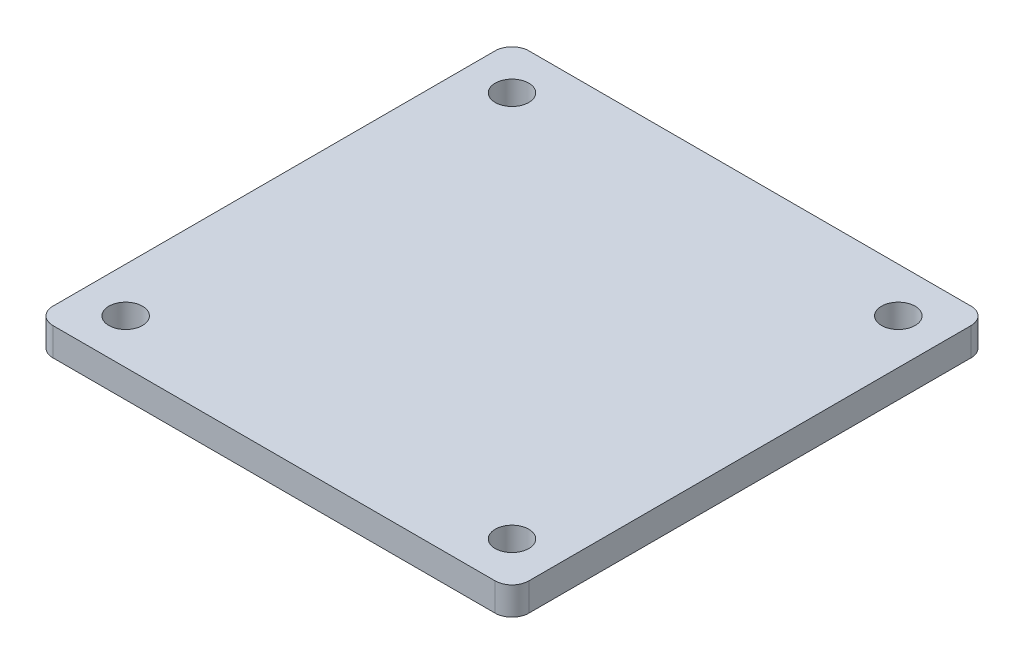
ISO-10303-21;
HEADER;
FILE_DESCRIPTION(('STEP AP214'),'2;1');
FILE_NAME('part.step','',(''),(''),'','','');
FILE_SCHEMA(('AUTOMOTIVE_DESIGN { 1 0 10303 214 1 1 1 1 }'));
ENDSEC;
DATA;
#1=APPLICATION_CONTEXT('core data for automotive mechanical design processes');
#2=APPLICATION_PROTOCOL_DEFINITION('international standard','automotive_design',2000,#1);
#3=PRODUCT_CONTEXT('',#1,'mechanical');
#4=PRODUCT('Part','Part','',(#3));
#5=PRODUCT_RELATED_PRODUCT_CATEGORY('part','',(#4));
#6=PRODUCT_DEFINITION_FORMATION('','',#4);
#7=PRODUCT_DEFINITION_CONTEXT('part definition',#1,'design');
#8=PRODUCT_DEFINITION('design','',#6,#7);
#9=PRODUCT_DEFINITION_SHAPE('','',#8);
#10=(LENGTH_UNIT() NAMED_UNIT(*) SI_UNIT(.MILLI.,.METRE.));
#11=(NAMED_UNIT(*) PLANE_ANGLE_UNIT() SI_UNIT($,.RADIAN.));
#12=(NAMED_UNIT(*) SI_UNIT($,.STERADIAN.) SOLID_ANGLE_UNIT());
#13=UNCERTAINTY_MEASURE_WITH_UNIT(LENGTH_MEASURE(1.E-05),#10,'distance_accuracy_value','');
#14=(GEOMETRIC_REPRESENTATION_CONTEXT(3) GLOBAL_UNCERTAINTY_ASSIGNED_CONTEXT((#13)) GLOBAL_UNIT_ASSIGNED_CONTEXT((#10,
#11,#12)) REPRESENTATION_CONTEXT('',''));
#15=CARTESIAN_POINT('',(0.,0.,0.));
#16=DIRECTION('',(0.,0.,1.));
#17=DIRECTION('',(1.,0.,0.));
#18=AXIS2_PLACEMENT_3D('',#15,#16,#17);
#19=CARTESIAN_POINT('',(42.5,5.,42.5));
#20=DIRECTION('',(-1.,0.,0.));
#21=DIRECTION('',(0.,0.,1.));
#22=AXIS2_PLACEMENT_3D('',#19,#20,#21);
#23=PLANE('',#22);
#24=DIRECTION('',(0.,0.,-1.));
#25=VECTOR('',#24,1.);
#26=CARTESIAN_POINT('',(42.5,0.,42.5));
#27=LINE('',#26,#25);
#28=CARTESIAN_POINT('',(42.5,0.,39.5));
#29=VERTEX_POINT('',#28);
#30=CARTESIAN_POINT('',(42.5,0.,-39.5));
#31=VERTEX_POINT('',#30);
#32=EDGE_CURVE('E133',#29,#31,#27,.T.);
#33=ORIENTED_EDGE('',*,*,#32,.T.);
#34=DIRECTION('',(0.,-1.,0.));
#35=VECTOR('',#34,1.);
#36=CARTESIAN_POINT('',(42.5,5.,-39.5));
#37=LINE('',#36,#35);
#38=CARTESIAN_POINT('',(42.5,5.,-39.5));
#39=VERTEX_POINT('',#38);
#40=EDGE_CURVE('E11',#31,#39,#37,.F.);
#41=ORIENTED_EDGE('',*,*,#40,.T.);
#42=DIRECTION('',(0.,0.,-1.));
#43=VECTOR('',#42,1.);
#44=CARTESIAN_POINT('',(42.5,5.,42.5));
#45=LINE('',#44,#43);
#46=CARTESIAN_POINT('',(42.5,5.,39.5));
#47=VERTEX_POINT('',#46);
#48=EDGE_CURVE('E131',#47,#39,#45,.T.);
#49=ORIENTED_EDGE('',*,*,#48,.F.);
#50=DIRECTION('',(0.,-1.,0.));
#51=VECTOR('',#50,1.);
#52=CARTESIAN_POINT('',(42.5,5.,39.5));
#53=LINE('',#52,#51);
#54=EDGE_CURVE('E45',#47,#29,#53,.T.);
#55=ORIENTED_EDGE('',*,*,#54,.T.);
#56=EDGE_LOOP('',(#33,#41,#49,#55));
#57=FACE_BOUND('',#56,.T.);
#58=ADVANCED_FACE('F37',(#57),#23,.F.);
#59=CARTESIAN_POINT('',(-42.5,5.,-42.5));
#60=DIRECTION('',(0.,0.,1.));
#61=DIRECTION('',(1.,0.,0.));
#62=AXIS2_PLACEMENT_3D('',#59,#60,#61);
#63=PLANE('',#62);
#64=DIRECTION('',(-1.,0.,0.));
#65=VECTOR('',#64,1.);
#66=CARTESIAN_POINT('',(-42.5,0.,-42.5));
#67=LINE('',#66,#65);
#68=CARTESIAN_POINT('',(39.5,0.,-42.5));
#69=VERTEX_POINT('',#68);
#70=CARTESIAN_POINT('',(-39.5,0.,-42.5));
#71=VERTEX_POINT('',#70);
#72=EDGE_CURVE('E129',#69,#71,#67,.T.);
#73=ORIENTED_EDGE('',*,*,#72,.T.);
#74=DIRECTION('',(0.,-1.,0.));
#75=VECTOR('',#74,1.);
#76=CARTESIAN_POINT('',(-39.5,5.,-42.5));
#77=LINE('',#76,#75);
#78=CARTESIAN_POINT('',(-39.5,5.,-42.5));
#79=VERTEX_POINT('',#78);
#80=EDGE_CURVE('E108',#71,#79,#77,.F.);
#81=ORIENTED_EDGE('',*,*,#80,.T.);
#82=DIRECTION('',(-1.,0.,0.));
#83=VECTOR('',#82,1.);
#84=CARTESIAN_POINT('',(-42.5,5.,-42.5));
#85=LINE('',#84,#83);
#86=CARTESIAN_POINT('',(39.5,5.,-42.5));
#87=VERTEX_POINT('',#86);
#88=EDGE_CURVE('E173',#87,#79,#85,.T.);
#89=ORIENTED_EDGE('',*,*,#88,.F.);
#90=DIRECTION('',(0.,-1.,0.));
#91=VECTOR('',#90,1.);
#92=CARTESIAN_POINT('',(39.5,5.,-42.5));
#93=LINE('',#92,#91);
#94=EDGE_CURVE('E113',#87,#69,#93,.T.);
#95=ORIENTED_EDGE('',*,*,#94,.T.);
#96=EDGE_LOOP('',(#73,#81,#89,#95));
#97=FACE_BOUND('',#96,.T.);
#98=ADVANCED_FACE('F219',(#97),#63,.F.);
#99=CARTESIAN_POINT('',(-42.5,5.,42.5));
#100=DIRECTION('',(1.,0.,0.));
#101=DIRECTION('',(0.,0.,-1.));
#102=AXIS2_PLACEMENT_3D('',#99,#100,#101);
#103=PLANE('',#102);
#104=DIRECTION('',(0.,0.,1.));
#105=VECTOR('',#104,1.);
#106=CARTESIAN_POINT('',(-42.5,5.,42.5));
#107=LINE('',#106,#105);
#108=CARTESIAN_POINT('',(-42.5,5.,-39.5));
#109=VERTEX_POINT('',#108);
#110=CARTESIAN_POINT('',(-42.5,5.,39.5));
#111=VERTEX_POINT('',#110);
#112=EDGE_CURVE('E122',#109,#111,#107,.T.);
#113=ORIENTED_EDGE('',*,*,#112,.F.);
#114=DIRECTION('',(0.,-1.,0.));
#115=VECTOR('',#114,1.);
#116=CARTESIAN_POINT('',(-42.5,5.,-39.5));
#117=LINE('',#116,#115);
#118=CARTESIAN_POINT('',(-42.5,0.,-39.5));
#119=VERTEX_POINT('',#118);
#120=EDGE_CURVE('E107',#109,#119,#117,.T.);
#121=ORIENTED_EDGE('',*,*,#120,.T.);
#122=DIRECTION('',(0.,0.,1.));
#123=VECTOR('',#122,1.);
#124=CARTESIAN_POINT('',(-42.5,0.,42.5));
#125=LINE('',#124,#123);
#126=CARTESIAN_POINT('',(-42.5,0.,39.5));
#127=VERTEX_POINT('',#126);
#128=EDGE_CURVE('E120',#119,#127,#125,.T.);
#129=ORIENTED_EDGE('',*,*,#128,.T.);
#130=DIRECTION('',(0.,-1.,0.));
#131=VECTOR('',#130,1.);
#132=CARTESIAN_POINT('',(-42.5,5.,39.5));
#133=LINE('',#132,#131);
#134=EDGE_CURVE('E124',#127,#111,#133,.F.);
#135=ORIENTED_EDGE('',*,*,#134,.T.);
#136=EDGE_LOOP('',(#113,#121,#129,#135));
#137=FACE_BOUND('',#136,.T.);
#138=ADVANCED_FACE('F119',(#137),#103,.F.);
#139=CARTESIAN_POINT('',(-42.5,5.,42.5));
#140=DIRECTION('',(0.,0.,-1.));
#141=DIRECTION('',(-1.,0.,0.));
#142=AXIS2_PLACEMENT_3D('',#139,#140,#141);
#143=PLANE('',#142);
#144=DIRECTION('',(1.,0.,0.));
#145=VECTOR('',#144,1.);
#146=CARTESIAN_POINT('',(-42.5,5.,42.5));
#147=LINE('',#146,#145);
#148=CARTESIAN_POINT('',(-39.5,5.,42.5));
#149=VERTEX_POINT('',#148);
#150=CARTESIAN_POINT('',(39.5,5.,42.5));
#151=VERTEX_POINT('',#150);
#152=EDGE_CURVE('E137',#149,#151,#147,.T.);
#153=ORIENTED_EDGE('',*,*,#152,.F.);
#154=DIRECTION('',(0.,-1.,0.));
#155=VECTOR('',#154,1.);
#156=CARTESIAN_POINT('',(-39.5,5.,42.5));
#157=LINE('',#156,#155);
#158=CARTESIAN_POINT('',(-39.5,0.,42.5));
#159=VERTEX_POINT('',#158);
#160=EDGE_CURVE('E154',#149,#159,#157,.T.);
#161=ORIENTED_EDGE('',*,*,#160,.T.);
#162=DIRECTION('',(1.,0.,0.));
#163=VECTOR('',#162,1.);
#164=CARTESIAN_POINT('',(-42.5,0.,42.5));
#165=LINE('',#164,#163);
#166=CARTESIAN_POINT('',(39.5,0.,42.5));
#167=VERTEX_POINT('',#166);
#168=EDGE_CURVE('E128',#159,#167,#165,.T.);
#169=ORIENTED_EDGE('',*,*,#168,.T.);
#170=DIRECTION('',(0.,-1.,0.));
#171=VECTOR('',#170,1.);
#172=CARTESIAN_POINT('',(39.5,5.,42.5));
#173=LINE('',#172,#171);
#174=EDGE_CURVE('E52',#167,#151,#173,.F.);
#175=ORIENTED_EDGE('',*,*,#174,.T.);
#176=EDGE_LOOP('',(#153,#161,#169,#175));
#177=FACE_BOUND('',#176,.T.);
#178=ADVANCED_FACE('F211',(#177),#143,.F.);
#179=CARTESIAN_POINT('',(0.,5.,0.));
#180=DIRECTION('',(0.,-1.,0.));
#181=DIRECTION('',(0.,0.,-1.));
#182=AXIS2_PLACEMENT_3D('',#179,#180,#181);
#183=PLANE('',#182);
#184=CARTESIAN_POINT('',(34.5,5.,-34.5));
#185=DIRECTION('',(0.,1.,0.));
#186=DIRECTION('',(0.,0.,-1.));
#187=AXIS2_PLACEMENT_3D('',#184,#185,#186);
#188=CIRCLE('',#187,3.);
#189=CARTESIAN_POINT('',(34.5,5.,-37.5));
#190=VERTEX_POINT('',#189);
#191=EDGE_CURVE('E180',#190,#190,#188,.T.);
#192=ORIENTED_EDGE('',*,*,#191,.F.);
#193=EDGE_LOOP('',(#192));
#194=FACE_BOUND('',#193,.T.);
#195=CARTESIAN_POINT('',(34.5,5.,34.5));
#196=DIRECTION('',(0.,1.,0.));
#197=DIRECTION('',(0.,0.,1.));
#198=AXIS2_PLACEMENT_3D('',#195,#196,#197);
#199=CIRCLE('',#198,3.);
#200=CARTESIAN_POINT('',(34.5,5.,37.5));
#201=VERTEX_POINT('',#200);
#202=EDGE_CURVE('E186',#201,#201,#199,.T.);
#203=ORIENTED_EDGE('',*,*,#202,.F.);
#204=EDGE_LOOP('',(#203));
#205=FACE_BOUND('',#204,.T.);
#206=CARTESIAN_POINT('',(-34.5,5.,34.5));
#207=DIRECTION('',(0.,1.,0.));
#208=DIRECTION('',(0.,0.,-1.));
#209=AXIS2_PLACEMENT_3D('',#206,#207,#208);
#210=CIRCLE('',#209,3.);
#211=CARTESIAN_POINT('',(-34.5,5.,31.5));
#212=VERTEX_POINT('',#211);
#213=EDGE_CURVE('E192',#212,#212,#210,.T.);
#214=ORIENTED_EDGE('',*,*,#213,.F.);
#215=EDGE_LOOP('',(#214));
#216=FACE_BOUND('',#215,.T.);
#217=CARTESIAN_POINT('',(-34.5,5.,-34.5));
#218=DIRECTION('',(0.,1.,0.));
#219=DIRECTION('',(0.,0.,1.));
#220=AXIS2_PLACEMENT_3D('',#217,#218,#219);
#221=CIRCLE('',#220,3.);
#222=CARTESIAN_POINT('',(-34.5,5.,-31.5));
#223=VERTEX_POINT('',#222);
#224=EDGE_CURVE('E168',#223,#223,#221,.T.);
#225=ORIENTED_EDGE('',*,*,#224,.F.);
#226=EDGE_LOOP('',(#225));
#227=FACE_BOUND('',#226,.T.);
#228=ORIENTED_EDGE('',*,*,#88,.T.);
#229=CARTESIAN_POINT('',(-39.5,5.,-39.5));
#230=DIRECTION('',(0.,-1.,0.));
#231=DIRECTION('',(0.,0.,-1.));
#232=AXIS2_PLACEMENT_3D('',#229,#230,#231);
#233=CIRCLE('',#232,3.);
#234=EDGE_CURVE('E151',#79,#109,#233,.F.);
#235=ORIENTED_EDGE('',*,*,#234,.T.);
#236=ORIENTED_EDGE('',*,*,#112,.T.);
#237=CARTESIAN_POINT('',(-39.5,5.,39.5));
#238=DIRECTION('',(0.,-1.,0.));
#239=DIRECTION('',(0.,0.,-1.));
#240=AXIS2_PLACEMENT_3D('',#237,#238,#239);
#241=CIRCLE('',#240,3.);
#242=EDGE_CURVE('E59',#111,#149,#241,.F.);
#243=ORIENTED_EDGE('',*,*,#242,.T.);
#244=ORIENTED_EDGE('',*,*,#152,.T.);
#245=CARTESIAN_POINT('',(39.5,5.,39.5));
#246=DIRECTION('',(0.,-1.,0.));
#247=DIRECTION('',(0.,0.,-1.));
#248=AXIS2_PLACEMENT_3D('',#245,#246,#247);
#249=CIRCLE('',#248,3.);
#250=EDGE_CURVE('E146',#151,#47,#249,.F.);
#251=ORIENTED_EDGE('',*,*,#250,.T.);
#252=ORIENTED_EDGE('',*,*,#48,.T.);
#253=CARTESIAN_POINT('',(39.5,5.,-39.5));
#254=DIRECTION('',(0.,-1.,0.));
#255=DIRECTION('',(0.,0.,-1.));
#256=AXIS2_PLACEMENT_3D('',#253,#254,#255);
#257=CIRCLE('',#256,3.);
#258=EDGE_CURVE('E148',#39,#87,#257,.F.);
#259=ORIENTED_EDGE('',*,*,#258,.T.);
#260=EDGE_LOOP('',(#228,#235,#236,#243,#244,#251,#252,#259));
#261=FACE_BOUND('',#260,.T.);
#262=ADVANCED_FACE('F208',(#194,#205,#216,#227,#261),#183,.F.);
#263=CARTESIAN_POINT('',(0.,0.,0.));
#264=DIRECTION('',(0.,-1.,0.));
#265=DIRECTION('',(0.,0.,-1.));
#266=AXIS2_PLACEMENT_3D('',#263,#264,#265);
#267=PLANE('',#266);
#268=CARTESIAN_POINT('',(34.5,0.,-34.5));
#269=DIRECTION('',(0.,1.,0.));
#270=DIRECTION('',(0.,0.,-1.));
#271=AXIS2_PLACEMENT_3D('',#268,#269,#270);
#272=CIRCLE('',#271,3.);
#273=CARTESIAN_POINT('',(34.5,0.,-37.5));
#274=VERTEX_POINT('',#273);
#275=EDGE_CURVE('E183',#274,#274,#272,.T.);
#276=ORIENTED_EDGE('',*,*,#275,.T.);
#277=EDGE_LOOP('',(#276));
#278=FACE_BOUND('',#277,.T.);
#279=CARTESIAN_POINT('',(34.5,0.,34.5));
#280=DIRECTION('',(0.,1.,0.));
#281=DIRECTION('',(0.,0.,1.));
#282=AXIS2_PLACEMENT_3D('',#279,#280,#281);
#283=CIRCLE('',#282,3.);
#284=CARTESIAN_POINT('',(34.5,0.,37.5));
#285=VERTEX_POINT('',#284);
#286=EDGE_CURVE('E189',#285,#285,#283,.T.);
#287=ORIENTED_EDGE('',*,*,#286,.T.);
#288=EDGE_LOOP('',(#287));
#289=FACE_BOUND('',#288,.T.);
#290=CARTESIAN_POINT('',(-34.5,0.,34.5));
#291=DIRECTION('',(0.,1.,0.));
#292=DIRECTION('',(0.,0.,-1.));
#293=AXIS2_PLACEMENT_3D('',#290,#291,#292);
#294=CIRCLE('',#293,3.);
#295=CARTESIAN_POINT('',(-34.5,0.,31.5));
#296=VERTEX_POINT('',#295);
#297=EDGE_CURVE('E178',#296,#296,#294,.T.);
#298=ORIENTED_EDGE('',*,*,#297,.T.);
#299=EDGE_LOOP('',(#298));
#300=FACE_BOUND('',#299,.T.);
#301=CARTESIAN_POINT('',(-34.5,0.,-34.5));
#302=DIRECTION('',(0.,1.,0.));
#303=DIRECTION('',(0.,0.,1.));
#304=AXIS2_PLACEMENT_3D('',#301,#302,#303);
#305=CIRCLE('',#304,3.);
#306=CARTESIAN_POINT('',(-34.5,0.,-31.5));
#307=VERTEX_POINT('',#306);
#308=EDGE_CURVE('E166',#307,#307,#305,.T.);
#309=ORIENTED_EDGE('',*,*,#308,.T.);
#310=EDGE_LOOP('',(#309));
#311=FACE_BOUND('',#310,.T.);
#312=ORIENTED_EDGE('',*,*,#128,.F.);
#313=CARTESIAN_POINT('',(-39.5,0.,-39.5));
#314=DIRECTION('',(0.,-1.,0.));
#315=DIRECTION('',(0.,0.,-1.));
#316=AXIS2_PLACEMENT_3D('',#313,#314,#315);
#317=CIRCLE('',#316,3.);
#318=EDGE_CURVE('E103',#119,#71,#317,.T.);
#319=ORIENTED_EDGE('',*,*,#318,.T.);
#320=ORIENTED_EDGE('',*,*,#72,.F.);
#321=CARTESIAN_POINT('',(39.5,0.,-39.5));
#322=DIRECTION('',(0.,-1.,0.));
#323=DIRECTION('',(0.,0.,-1.));
#324=AXIS2_PLACEMENT_3D('',#321,#322,#323);
#325=CIRCLE('',#324,3.);
#326=EDGE_CURVE('E140',#69,#31,#325,.T.);
#327=ORIENTED_EDGE('',*,*,#326,.T.);
#328=ORIENTED_EDGE('',*,*,#32,.F.);
#329=CARTESIAN_POINT('',(39.5,0.,39.5));
#330=DIRECTION('',(0.,-1.,0.));
#331=DIRECTION('',(0.,0.,-1.));
#332=AXIS2_PLACEMENT_3D('',#329,#330,#331);
#333=CIRCLE('',#332,3.);
#334=EDGE_CURVE('E123',#29,#167,#333,.T.);
#335=ORIENTED_EDGE('',*,*,#334,.T.);
#336=ORIENTED_EDGE('',*,*,#168,.F.);
#337=CARTESIAN_POINT('',(-39.5,0.,39.5));
#338=DIRECTION('',(0.,-1.,0.));
#339=DIRECTION('',(0.,0.,-1.));
#340=AXIS2_PLACEMENT_3D('',#337,#338,#339);
#341=CIRCLE('',#340,3.);
#342=EDGE_CURVE('E114',#159,#127,#341,.T.);
#343=ORIENTED_EDGE('',*,*,#342,.T.);
#344=EDGE_LOOP('',(#312,#319,#320,#327,#328,#335,#336,#343));
#345=FACE_BOUND('',#344,.T.);
#346=ADVANCED_FACE('F126',(#278,#289,#300,#311,#345),#267,.T.);
#347=CARTESIAN_POINT('',(-39.5,5.,-39.5));
#348=DIRECTION('',(0.,-1.,0.));
#349=DIRECTION('',(0.,0.,-1.));
#350=AXIS2_PLACEMENT_3D('',#347,#348,#349);
#351=CYLINDRICAL_SURFACE('',#350,3.);
#352=ORIENTED_EDGE('',*,*,#234,.F.);
#353=ORIENTED_EDGE('',*,*,#80,.F.);
#354=ORIENTED_EDGE('',*,*,#318,.F.);
#355=ORIENTED_EDGE('',*,*,#120,.F.);
#356=EDGE_LOOP('',(#352,#353,#354,#355));
#357=FACE_BOUND('',#356,.T.);
#358=ADVANCED_FACE('F106',(#357),#351,.T.);
#359=CARTESIAN_POINT('',(-39.5,5.,39.5));
#360=DIRECTION('',(0.,-1.,0.));
#361=DIRECTION('',(0.,0.,-1.));
#362=AXIS2_PLACEMENT_3D('',#359,#360,#361);
#363=CYLINDRICAL_SURFACE('',#362,3.);
#364=ORIENTED_EDGE('',*,*,#242,.F.);
#365=ORIENTED_EDGE('',*,*,#134,.F.);
#366=ORIENTED_EDGE('',*,*,#342,.F.);
#367=ORIENTED_EDGE('',*,*,#160,.F.);
#368=EDGE_LOOP('',(#364,#365,#366,#367));
#369=FACE_BOUND('',#368,.T.);
#370=ADVANCED_FACE('F229',(#369),#363,.T.);
#371=CARTESIAN_POINT('',(39.5,5.,-39.5));
#372=DIRECTION('',(0.,-1.,0.));
#373=DIRECTION('',(0.,0.,-1.));
#374=AXIS2_PLACEMENT_3D('',#371,#372,#373);
#375=CYLINDRICAL_SURFACE('',#374,3.);
#376=ORIENTED_EDGE('',*,*,#258,.F.);
#377=ORIENTED_EDGE('',*,*,#40,.F.);
#378=ORIENTED_EDGE('',*,*,#326,.F.);
#379=ORIENTED_EDGE('',*,*,#94,.F.);
#380=EDGE_LOOP('',(#376,#377,#378,#379));
#381=FACE_BOUND('',#380,.T.);
#382=ADVANCED_FACE('F221',(#381),#375,.T.);
#383=CARTESIAN_POINT('',(39.5,5.,39.5));
#384=DIRECTION('',(0.,-1.,0.));
#385=DIRECTION('',(0.,0.,-1.));
#386=AXIS2_PLACEMENT_3D('',#383,#384,#385);
#387=CYLINDRICAL_SURFACE('',#386,3.);
#388=ORIENTED_EDGE('',*,*,#250,.F.);
#389=ORIENTED_EDGE('',*,*,#174,.F.);
#390=ORIENTED_EDGE('',*,*,#334,.F.);
#391=ORIENTED_EDGE('',*,*,#54,.F.);
#392=EDGE_LOOP('',(#388,#389,#390,#391));
#393=FACE_BOUND('',#392,.T.);
#394=ADVANCED_FACE('F39',(#393),#387,.T.);
#395=CARTESIAN_POINT('',(-34.5,0.,-34.5));
#396=DIRECTION('',(0.,1.,0.));
#397=DIRECTION('',(0.,0.,1.));
#398=AXIS2_PLACEMENT_3D('',#395,#396,#397);
#399=CYLINDRICAL_SURFACE('',#398,3.);
#400=ORIENTED_EDGE('',*,*,#308,.F.);
#401=EDGE_LOOP('',(#400));
#402=FACE_BOUND('',#401,.T.);
#403=ORIENTED_EDGE('',*,*,#224,.T.);
#404=EDGE_LOOP('',(#403));
#405=FACE_BOUND('',#404,.T.);
#406=ADVANCED_FACE('F204',(#402,#405),#399,.F.);
#407=CARTESIAN_POINT('',(-34.5,0.,34.5));
#408=DIRECTION('',(0.,1.,0.));
#409=DIRECTION('',(0.,0.,1.));
#410=AXIS2_PLACEMENT_3D('',#407,#408,#409);
#411=CYLINDRICAL_SURFACE('',#410,3.);
#412=ORIENTED_EDGE('',*,*,#297,.F.);
#413=EDGE_LOOP('',(#412));
#414=FACE_BOUND('',#413,.T.);
#415=ORIENTED_EDGE('',*,*,#213,.T.);
#416=EDGE_LOOP('',(#415));
#417=FACE_BOUND('',#416,.T.);
#418=ADVANCED_FACE('F200',(#414,#417),#411,.F.);
#419=CARTESIAN_POINT('',(34.5,0.,34.5));
#420=DIRECTION('',(0.,1.,0.));
#421=DIRECTION('',(0.,0.,1.));
#422=AXIS2_PLACEMENT_3D('',#419,#420,#421);
#423=CYLINDRICAL_SURFACE('',#422,3.);
#424=ORIENTED_EDGE('',*,*,#286,.F.);
#425=EDGE_LOOP('',(#424));
#426=FACE_BOUND('',#425,.T.);
#427=ORIENTED_EDGE('',*,*,#202,.T.);
#428=EDGE_LOOP('',(#427));
#429=FACE_BOUND('',#428,.T.);
#430=ADVANCED_FACE('F203',(#426,#429),#423,.F.);
#431=CARTESIAN_POINT('',(34.5,0.,-34.5));
#432=DIRECTION('',(0.,1.,0.));
#433=DIRECTION('',(0.,0.,1.));
#434=AXIS2_PLACEMENT_3D('',#431,#432,#433);
#435=CYLINDRICAL_SURFACE('',#434,3.);
#436=ORIENTED_EDGE('',*,*,#275,.F.);
#437=EDGE_LOOP('',(#436));
#438=FACE_BOUND('',#437,.T.);
#439=ORIENTED_EDGE('',*,*,#191,.T.);
#440=EDGE_LOOP('',(#439));
#441=FACE_BOUND('',#440,.T.);
#442=ADVANCED_FACE('F254',(#438,#441),#435,.F.);
#443=CLOSED_SHELL('',(#58,#98,#138,#178,#262,#346,#358,#370,#382,#394,#406,#418,#430,#442));
#444=MANIFOLD_SOLID_BREP('B2',#443);
#445=ADVANCED_BREP_SHAPE_REPRESENTATION('',(#18,#444),#14);
#446=SHAPE_DEFINITION_REPRESENTATION(#9,#445);
ENDSEC;
END-ISO-10303-21;
